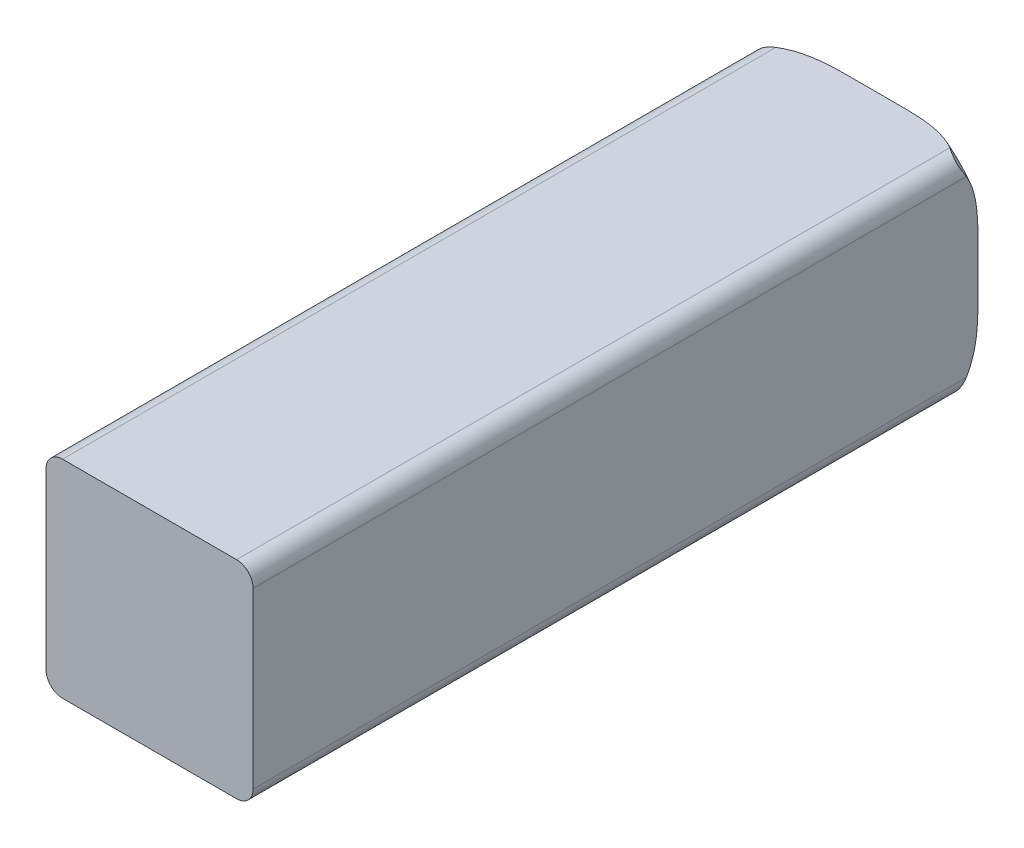
ISO-10303-21;
HEADER;
FILE_DESCRIPTION(('STEP AP214'),'2;1');
FILE_NAME('part.step','',(''),(''),'','','');
FILE_SCHEMA(('AUTOMOTIVE_DESIGN { 1 0 10303 214 1 1 1 1 }'));
ENDSEC;
DATA;
#1=APPLICATION_CONTEXT('core data for automotive mechanical design processes');
#2=APPLICATION_PROTOCOL_DEFINITION('international standard','automotive_design',2000,#1);
#3=PRODUCT_CONTEXT('',#1,'mechanical');
#4=PRODUCT('Part','Part','',(#3));
#5=PRODUCT_RELATED_PRODUCT_CATEGORY('part','',(#4));
#6=PRODUCT_DEFINITION_FORMATION('','',#4);
#7=PRODUCT_DEFINITION_CONTEXT('part definition',#1,'design');
#8=PRODUCT_DEFINITION('design','',#6,#7);
#9=PRODUCT_DEFINITION_SHAPE('','',#8);
#10=(LENGTH_UNIT() NAMED_UNIT(*) SI_UNIT(.MILLI.,.METRE.));
#11=(NAMED_UNIT(*) PLANE_ANGLE_UNIT() SI_UNIT($,.RADIAN.));
#12=(NAMED_UNIT(*) SI_UNIT($,.STERADIAN.) SOLID_ANGLE_UNIT());
#13=UNCERTAINTY_MEASURE_WITH_UNIT(LENGTH_MEASURE(1.E-05),#10,'distance_accuracy_value','');
#14=(GEOMETRIC_REPRESENTATION_CONTEXT(3) GLOBAL_UNCERTAINTY_ASSIGNED_CONTEXT((#13)) GLOBAL_UNIT_ASSIGNED_CONTEXT((#10,
#11,#12)) REPRESENTATION_CONTEXT('',''));
#15=CARTESIAN_POINT('',(0.,0.,0.));
#16=DIRECTION('',(0.,0.,1.));
#17=DIRECTION('',(1.,0.,0.));
#18=AXIS2_PLACEMENT_3D('',#15,#16,#17);
#19=CARTESIAN_POINT('',(0.,0.,-24.765));
#20=DIRECTION('',(0.,0.,1.));
#21=DIRECTION('',(1.,0.,0.));
#22=AXIS2_PLACEMENT_3D('',#19,#20,#21);
#23=TOROIDAL_SURFACE('',#22,1.63185378542452,0.635);
#24=CARTESIAN_POINT('',(1.5875,-1.33350000000001,-25.2214993180159));
#25=CARTESIAN_POINT('',(1.58748566897288,-1.34690792462914,-25.2131902383444));
#26=CARTESIAN_POINT('',(1.58643563491714,-1.36046268636275,-25.2049732030893));
#27=CARTESIAN_POINT('',(1.58201648662521,-1.38783838491251,-25.1892469870888));
#28=CARTESIAN_POINT('',(1.57861670279278,-1.40166046367848,-25.1817486789985));
#29=CARTESIAN_POINT('',(1.57058714220896,-1.42521880461481,-25.1701813537226));
#30=CARTESIAN_POINT('',(1.56659229292943,-1.43498690476737,-25.1657462781291));
#31=CARTESIAN_POINT('',(1.55721249958346,-1.45425932377619,-25.1580014330523));
#32=CARTESIAN_POINT('',(1.55183414419047,-1.46376466264463,-25.1546864976667));
#33=CARTESIAN_POINT('',(1.54064277647373,-1.48078992954893,-25.1499494031102));
#34=CARTESIAN_POINT('',(1.53503704758616,-1.48838416094885,-25.1483092418591));
#35=CARTESIAN_POINT('',(1.52291375209376,-1.50299443314631,-25.1462529778718));
#36=CARTESIAN_POINT('',(1.51639639905189,-1.51001060875298,-25.1458365889481));
#37=CARTESIAN_POINT('',(1.50263078678935,-1.52324184577942,-25.1462804295973));
#38=CARTESIAN_POINT('',(1.49538231587763,-1.52945667397998,-25.1471410299099));
#39=CARTESIAN_POINT('',(1.48038761855587,-1.54093535352863,-25.1500339763629));
#40=CARTESIAN_POINT('',(1.47264109349684,-1.54619862694723,-25.1520670314777));
#41=CARTESIAN_POINT('',(1.45446300659162,-1.5571701281181,-25.157864814596));
#42=CARTESIAN_POINT('',(1.44392996611573,-1.56252875091595,-25.161967806468));
#43=CARTESIAN_POINT('',(1.42264994892328,-1.57162418246107,-25.1713367713514));
#44=CARTESIAN_POINT('',(1.41190224866778,-1.57535394035416,-25.1766076544231));
#45=CARTESIAN_POINT('',(1.38976321513481,-1.58147222213898,-25.1882192454684));
#46=CARTESIAN_POINT('',(1.37837092259127,-1.58376977522872,-25.1946044346479));
#47=CARTESIAN_POINT('',(1.35579141019531,-1.58677095199112,-25.2078013248425));
#48=CARTESIAN_POINT('',(1.34460332096514,-1.58749208945789,-25.2146074664251));
#49=CARTESIAN_POINT('',(1.3335,-1.5875,-25.2214993180159));
#50=B_SPLINE_CURVE_WITH_KNOTS('',3,(#24,#25,#26,#27,#28,#29,#30,#31,#32,#33,#34,#35,#36,#37,#38,
#39,#40,#41,#42,#43,#44,#45,#46,#47,#48,#49),.UNSPECIFIED.,.F.,.F.,(4,2,2,2,2,2,2,2,2,2,2,2,4),
(0.,0.0474135575383103,0.0954579548320137,0.129685196647701,0.163752362077394,0.192367952546176,
0.220976850534815,0.249594055977997,0.278228584196794,0.315551990426709,0.353035394369269,
0.392706187180634,0.43193395327049),.UNSPECIFIED.);
#51=CARTESIAN_POINT('',(1.58749999999933,-1.33349999999976,-25.2214993180163));
#52=VERTEX_POINT('',#51);
#53=CARTESIAN_POINT('',(1.3335,-1.5875,-25.2214993180159));
#54=VERTEX_POINT('',#53);
#55=EDGE_CURVE('E138',#52,#54,#50,.T.);
#56=ORIENTED_EDGE('',*,*,#55,.T.);
#57=CARTESIAN_POINT('',(1.3335,-1.5875,-25.2214993180159));
#58=CARTESIAN_POINT('',(1.31039310118339,-1.5875,-25.2358652995629));
#59=CARTESIAN_POINT('',(1.2865956642968,-1.5875,-25.2490482576007));
#60=CARTESIAN_POINT('',(1.23796868030271,-1.5875,-25.2732235603891));
#61=CARTESIAN_POINT('',(1.21314134560692,-1.5875,-25.284220334021));
#62=CARTESIAN_POINT('',(1.13821413543874,-1.5875,-25.313985593762));
#63=CARTESIAN_POINT('',(1.08698851455542,-1.5875,-25.3299288510369));
#64=CARTESIAN_POINT('',(0.999962751237763,-1.5875,-25.3515855860613));
#65=CARTESIAN_POINT('',(0.964535612837992,-1.5875,-25.3589398885291));
#66=CARTESIAN_POINT('',(0.893247688923865,-1.5875,-25.3713838801317));
#67=CARTESIAN_POINT('',(0.857386498395727,-1.5875,-25.3764712545345));
#68=CARTESIAN_POINT('',(0.785399533338706,-1.5875,-25.3848313870659));
#69=CARTESIAN_POINT('',(0.749273402082695,-1.5875,-25.3881009072115));
#70=CARTESIAN_POINT('',(0.675801730227447,-1.5875,-25.3933189638327));
#71=CARTESIAN_POINT('',(0.638453184386328,-1.5875,-25.3952232897935));
#72=CARTESIAN_POINT('',(0.563797247200004,-1.5875,-25.3979718892388));
#73=CARTESIAN_POINT('',(0.526489923948468,-1.5875,-25.3988182849851));
#74=CARTESIAN_POINT('',(0.452078339022183,-1.5875,-25.3998256272711));
#75=CARTESIAN_POINT('',(0.414974136365072,-1.5875,-25.3999904665671));
#76=CARTESIAN_POINT('',(0.377876338243536,-1.5875,-25.4));
#77=B_SPLINE_CURVE_WITH_KNOTS('',3,(#57,#58,#59,#60,#61,#62,#63,#64,#65,#66,#67,#68,#69,#70,#71,
#72,#73,#74,#75,#76),.UNSPECIFIED.,.F.,.F.,(4,2,2,2,2,2,2,2,2,4),(0.,0.0815326247959326,
0.162898354774419,0.323290286001704,0.431774886900757,0.540370007655983,0.649157944635815,
0.761326732026148,0.873270140095043,0.984573284944613),.UNSPECIFIED.);
#78=CARTESIAN_POINT('',(0.377876338243536,-1.5875,-25.4));
#79=VERTEX_POINT('',#78);
#80=EDGE_CURVE('E143',#54,#79,#77,.T.);
#81=ORIENTED_EDGE('',*,*,#80,.T.);
#82=CARTESIAN_POINT('',(0.,0.,-25.4));
#83=DIRECTION('',(0.,0.,1.));
#84=DIRECTION('',(0.231562620143221,-0.97282000028392,0.));
#85=AXIS2_PLACEMENT_3D('',#82,#83,#84);
#86=CIRCLE('',#85,1.63185378542452);
#87=CARTESIAN_POINT('',(1.5875,-0.377876338243537,-25.4));
#88=VERTEX_POINT('',#87);
#89=EDGE_CURVE('E124',#88,#79,#86,.F.);
#90=ORIENTED_EDGE('',*,*,#89,.F.);
#91=CARTESIAN_POINT('',(1.5875,-0.377876338243537,-25.4));
#92=CARTESIAN_POINT('',(1.5875,-0.411612509119626,-25.3999933751559));
#93=CARTESIAN_POINT('',(1.5875,-0.445352736805657,-25.3998557902654));
#94=CARTESIAN_POINT('',(1.5875,-0.512942907948327,-25.3990478407271));
#95=CARTESIAN_POINT('',(1.5875,-0.546792826939162,-25.3983756336304));
#96=CARTESIAN_POINT('',(1.5875,-0.614509507764878,-25.3962226303108));
#97=CARTESIAN_POINT('',(1.5875,-0.648376243547029,-25.3947408964801));
#98=CARTESIAN_POINT('',(1.5875,-0.715189437993944,-25.3907056324485));
#99=CARTESIAN_POINT('',(1.5875,-0.748137535690098,-25.3881801182269));
#100=CARTESIAN_POINT('',(1.5875,-0.813874511250842,-25.3817497399492));
#101=CARTESIAN_POINT('',(1.5875,-0.846663515341614,-25.3778462570928));
#102=CARTESIAN_POINT('',(1.5875,-0.911972001446369,-25.3683282433345));
#103=CARTESIAN_POINT('',(1.5875,-0.944491567482064,-25.3627142681786));
#104=CARTESIAN_POINT('',(1.58750000000001,-1.03884990510626,-25.3432957352134));
#105=CARTESIAN_POINT('',(1.58750000000004,-1.10020590566776,-25.326702751592));
#106=CARTESIAN_POINT('',(1.58749999999999,-1.17979261140478,-25.297655047337));
#107=CARTESIAN_POINT('',(1.58749999999997,-1.19970518510336,-25.2897223580693));
#108=CARTESIAN_POINT('',(1.58750000000004,-1.23899757921714,-25.272570532428));
#109=CARTESIAN_POINT('',(1.58750000000013,-1.25837690634234,-25.2633502498628));
#110=CARTESIAN_POINT('',(1.58749999999987,-1.29648737036626,-25.243502020843));
#111=CARTESIAN_POINT('',(1.58749999999952,-1.31521592279952,-25.232869126592));
#112=CARTESIAN_POINT('',(1.58749999999867,-1.3334999999995,-25.2214993180167));
#113=B_SPLINE_CURVE_WITH_KNOTS('',3,(#91,#92,#93,#94,#95,#96,#97,#98,#99,#100,#101,#102,#103,
#104,#105,#106,#107,#108,#109,#110,#111,#112),.UNSPECIFIED.,.F.,.F.,(4,2,2,2,2,2,2,2,2,2,4),(0.,
0.101214578869633,0.202779489233488,0.304462283979966,0.403576841200485,0.502592332234145,
0.601575686961526,0.791402246158587,0.855672419606408,0.920000174261183,0.984559494506422),.UNSPECIFIED.);
#114=EDGE_CURVE('E85',#88,#52,#113,.T.);
#115=ORIENTED_EDGE('',*,*,#114,.T.);
#116=EDGE_LOOP('',(#56,#81,#90,#115));
#117=FACE_BOUND('',#116,.T.);
#118=ADVANCED_FACE('F33',(#117),#23,.T.);
#119=CARTESIAN_POINT('',(0.,0.,-24.765));
#120=DIRECTION('',(0.,0.,1.));
#121=DIRECTION('',(1.,0.,0.));
#122=AXIS2_PLACEMENT_3D('',#119,#120,#121);
#123=TOROIDAL_SURFACE('',#122,1.63185378542452,0.635);
#124=CARTESIAN_POINT('',(-1.33350000000001,-1.5875,-25.2214993180159));
#125=CARTESIAN_POINT('',(-1.34690792462914,-1.58748566897288,-25.2131902383444));
#126=CARTESIAN_POINT('',(-1.36046268636275,-1.58643563491714,-25.2049732030893));
#127=CARTESIAN_POINT('',(-1.38783838491252,-1.5820164866252,-25.1892469870888));
#128=CARTESIAN_POINT('',(-1.40166046367848,-1.57861670279278,-25.1817486789985));
#129=CARTESIAN_POINT('',(-1.42521880461481,-1.57058714220896,-25.1701813537226));
#130=CARTESIAN_POINT('',(-1.43498690476738,-1.56659229292943,-25.1657462781291));
#131=CARTESIAN_POINT('',(-1.45425932377619,-1.55721249958346,-25.1580014330523));
#132=CARTESIAN_POINT('',(-1.46376466264463,-1.55183414419047,-25.1546864976667));
#133=CARTESIAN_POINT('',(-1.48078992954894,-1.54064277647373,-25.1499494031102));
#134=CARTESIAN_POINT('',(-1.48838416094885,-1.53503704758616,-25.1483092418591));
#135=CARTESIAN_POINT('',(-1.50299443314631,-1.52291375209376,-25.1462529778718));
#136=CARTESIAN_POINT('',(-1.51001060875298,-1.51639639905189,-25.1458365889481));
#137=CARTESIAN_POINT('',(-1.52324184577942,-1.50263078678935,-25.1462804295973));
#138=CARTESIAN_POINT('',(-1.52945667397998,-1.49538231587763,-25.1471410299099));
#139=CARTESIAN_POINT('',(-1.54093535352863,-1.48038761855587,-25.1500339763629));
#140=CARTESIAN_POINT('',(-1.54619862694723,-1.47264109349684,-25.1520670314777));
#141=CARTESIAN_POINT('',(-1.5571701281181,-1.45446300659162,-25.157864814596));
#142=CARTESIAN_POINT('',(-1.56252875091595,-1.44392996611573,-25.161967806468));
#143=CARTESIAN_POINT('',(-1.57162418246107,-1.42264994892329,-25.1713367713514));
#144=CARTESIAN_POINT('',(-1.57535394035416,-1.41190224866778,-25.1766076544231));
#145=CARTESIAN_POINT('',(-1.58147222213898,-1.38976321513481,-25.1882192454684));
#146=CARTESIAN_POINT('',(-1.58376977522872,-1.37837092259127,-25.1946044346479));
#147=CARTESIAN_POINT('',(-1.58677095199112,-1.35579141019531,-25.2078013248425));
#148=CARTESIAN_POINT('',(-1.58749208945789,-1.34460332096514,-25.2146074664251));
#149=CARTESIAN_POINT('',(-1.5875,-1.3335,-25.2214993180159));
#150=B_SPLINE_CURVE_WITH_KNOTS('',3,(#124,#125,#126,#127,#128,#129,#130,#131,#132,#133,#134,
#135,#136,#137,#138,#139,#140,#141,#142,#143,#144,#145,#146,#147,#148,#149),.UNSPECIFIED.,.F.,
.F.,(4,2,2,2,2,2,2,2,2,2,2,2,4),(0.,0.0474135575383122,0.0954579548320149,0.129685196647703,
0.163752362077395,0.192367952546178,0.220976850534816,0.249594055977996,0.278228584196794,
0.315551990426708,0.353035394369269,0.392706187180634,0.431933953270492),.UNSPECIFIED.);
#151=CARTESIAN_POINT('',(-1.33349999999976,-1.58749999999933,-25.2214993180163));
#152=VERTEX_POINT('',#151);
#153=CARTESIAN_POINT('',(-1.5875,-1.3335,-25.2214993180159));
#154=VERTEX_POINT('',#153);
#155=EDGE_CURVE('E302',#152,#154,#150,.T.);
#156=ORIENTED_EDGE('',*,*,#155,.T.);
#157=CARTESIAN_POINT('',(-1.5875,-1.3335,-25.2214993180159));
#158=CARTESIAN_POINT('',(-1.5875,-1.31039310118339,-25.2358652995629));
#159=CARTESIAN_POINT('',(-1.5875,-1.2865956642968,-25.2490482576007));
#160=CARTESIAN_POINT('',(-1.5875,-1.23796868030272,-25.2732235603891));
#161=CARTESIAN_POINT('',(-1.5875,-1.21314134560692,-25.284220334021));
#162=CARTESIAN_POINT('',(-1.5875,-1.13821413543874,-25.313985593762));
#163=CARTESIAN_POINT('',(-1.58749999999999,-1.08698851455542,-25.3299288510369));
#164=CARTESIAN_POINT('',(-1.5875,-0.999962751237764,-25.3515855860613));
#165=CARTESIAN_POINT('',(-1.5875,-0.964535612837993,-25.3589398885291));
#166=CARTESIAN_POINT('',(-1.5875,-0.893247688923866,-25.3713838801317));
#167=CARTESIAN_POINT('',(-1.5875,-0.857386498395727,-25.3764712545345));
#168=CARTESIAN_POINT('',(-1.5875,-0.785399533338707,-25.3848313870659));
#169=CARTESIAN_POINT('',(-1.5875,-0.749273402082695,-25.3881009072115));
#170=CARTESIAN_POINT('',(-1.5875,-0.675801730227448,-25.3933189638327));
#171=CARTESIAN_POINT('',(-1.5875,-0.638453184386328,-25.3952232897935));
#172=CARTESIAN_POINT('',(-1.5875,-0.563797247200004,-25.3979718892388));
#173=CARTESIAN_POINT('',(-1.5875,-0.526489923948468,-25.3988182849851));
#174=CARTESIAN_POINT('',(-1.5875,-0.452078339022183,-25.3998256272711));
#175=CARTESIAN_POINT('',(-1.5875,-0.414974136365072,-25.3999904665671));
#176=CARTESIAN_POINT('',(-1.5875,-0.377876338243537,-25.4));
#177=B_SPLINE_CURVE_WITH_KNOTS('',3,(#157,#158,#159,#160,#161,#162,#163,#164,#165,#166,#167,
#168,#169,#170,#171,#172,#173,#174,#175,#176),.UNSPECIFIED.,.F.,.F.,(4,2,2,2,2,2,2,2,2,4),(0.,
0.0815326247959322,0.162898354774419,0.323290286001703,0.431774886900756,0.540370007655982,
0.649157944635815,0.761326732026148,0.873270140095042,0.984573284944613),.UNSPECIFIED.);
#178=CARTESIAN_POINT('',(-1.5875,-0.377876338243537,-25.4));
#179=VERTEX_POINT('',#178);
#180=EDGE_CURVE('E301',#154,#179,#177,.T.);
#181=ORIENTED_EDGE('',*,*,#180,.T.);
#182=CARTESIAN_POINT('',(0.,0.,-25.4));
#183=DIRECTION('',(0.,0.,1.));
#184=DIRECTION('',(-0.97282000028392,-0.231562620143221,0.));
#185=AXIS2_PLACEMENT_3D('',#182,#183,#184);
#186=CIRCLE('',#185,1.63185378542452);
#187=CARTESIAN_POINT('',(-0.377876338243537,-1.5875,-25.4));
#188=VERTEX_POINT('',#187);
#189=EDGE_CURVE('E197',#188,#179,#186,.F.);
#190=ORIENTED_EDGE('',*,*,#189,.F.);
#191=CARTESIAN_POINT('',(-0.377876338243537,-1.5875,-25.4));
#192=CARTESIAN_POINT('',(-0.411612509119626,-1.5875,-25.3999933751559));
#193=CARTESIAN_POINT('',(-0.445352736805656,-1.5875,-25.3998557902654));
#194=CARTESIAN_POINT('',(-0.512942907948327,-1.5875,-25.3990478407271));
#195=CARTESIAN_POINT('',(-0.546792826939162,-1.5875,-25.3983756336304));
#196=CARTESIAN_POINT('',(-0.614509507764878,-1.5875,-25.3962226303108));
#197=CARTESIAN_POINT('',(-0.648376243547029,-1.5875,-25.3947408964801));
#198=CARTESIAN_POINT('',(-0.715189437993944,-1.5875,-25.3907056324485));
#199=CARTESIAN_POINT('',(-0.748137535690098,-1.5875,-25.3881801182269));
#200=CARTESIAN_POINT('',(-0.813874511250842,-1.5875,-25.3817497399492));
#201=CARTESIAN_POINT('',(-0.846663515341614,-1.5875,-25.3778462570928));
#202=CARTESIAN_POINT('',(-0.911972001446368,-1.5875,-25.3683282433345));
#203=CARTESIAN_POINT('',(-0.944491567482064,-1.5875,-25.3627142681786));
#204=CARTESIAN_POINT('',(-1.03884990510626,-1.58750000000001,-25.3432957352134));
#205=CARTESIAN_POINT('',(-1.10020590566776,-1.58750000000004,-25.326702751592));
#206=CARTESIAN_POINT('',(-1.17979261140478,-1.58749999999999,-25.297655047337));
#207=CARTESIAN_POINT('',(-1.19970518510336,-1.58749999999997,-25.2897223580693));
#208=CARTESIAN_POINT('',(-1.23899757921714,-1.58750000000004,-25.272570532428));
#209=CARTESIAN_POINT('',(-1.25837690634234,-1.58750000000013,-25.2633502498628));
#210=CARTESIAN_POINT('',(-1.29648737036626,-1.58749999999987,-25.243502020843));
#211=CARTESIAN_POINT('',(-1.31521592279952,-1.58749999999952,-25.232869126592));
#212=CARTESIAN_POINT('',(-1.3334999999995,-1.58749999999867,-25.2214993180167));
#213=B_SPLINE_CURVE_WITH_KNOTS('',3,(#191,#192,#193,#194,#195,#196,#197,#198,#199,#200,#201,
#202,#203,#204,#205,#206,#207,#208,#209,#210,#211,#212),.UNSPECIFIED.,.F.,.F.,(4,2,2,2,2,2,2,2,
2,2,4),(0.,0.101214578869633,0.202779489233488,0.304462283979966,0.403576841200485,
0.502592332234144,0.601575686961526,0.791402246158587,0.855672419606408,0.920000174261183,
0.984559494506423),.UNSPECIFIED.);
#214=EDGE_CURVE('E308',#188,#152,#213,.T.);
#215=ORIENTED_EDGE('',*,*,#214,.T.);
#216=EDGE_LOOP('',(#156,#181,#190,#215));
#217=FACE_BOUND('',#216,.T.);
#218=ADVANCED_FACE('F258',(#217),#123,.T.);
#219=CARTESIAN_POINT('',(0.,0.,-24.765));
#220=DIRECTION('',(0.,0.,1.));
#221=DIRECTION('',(1.,0.,0.));
#222=AXIS2_PLACEMENT_3D('',#219,#220,#221);
#223=TOROIDAL_SURFACE('',#222,1.63185378542452,0.635);
#224=CARTESIAN_POINT('',(0.,0.,-25.4));
#225=DIRECTION('',(0.,0.,1.));
#226=DIRECTION('',(-0.231562620143221,0.97282000028392,0.));
#227=AXIS2_PLACEMENT_3D('',#224,#225,#226);
#228=CIRCLE('',#227,1.63185378542452);
#229=CARTESIAN_POINT('',(-1.5875,0.377876338243537,-25.4));
#230=VERTEX_POINT('',#229);
#231=CARTESIAN_POINT('',(-0.377876338243537,1.5875,-25.4));
#232=VERTEX_POINT('',#231);
#233=EDGE_CURVE('E210',#230,#232,#228,.F.);
#234=ORIENTED_EDGE('',*,*,#233,.F.);
#235=CARTESIAN_POINT('',(-1.5875,0.377876338243537,-25.4));
#236=CARTESIAN_POINT('',(-1.5875,0.411612509119626,-25.3999933751559));
#237=CARTESIAN_POINT('',(-1.5875,0.445352736805657,-25.3998557902654));
#238=CARTESIAN_POINT('',(-1.5875,0.512942907948327,-25.3990478407271));
#239=CARTESIAN_POINT('',(-1.5875,0.546792826939162,-25.3983756336304));
#240=CARTESIAN_POINT('',(-1.5875,0.614509507764879,-25.3962226303108));
#241=CARTESIAN_POINT('',(-1.5875,0.64837624354703,-25.3947408964801));
#242=CARTESIAN_POINT('',(-1.5875,0.715189437993945,-25.3907056324485));
#243=CARTESIAN_POINT('',(-1.5875,0.748137535690099,-25.3881801182269));
#244=CARTESIAN_POINT('',(-1.5875,0.813874511250844,-25.3817497399492));
#245=CARTESIAN_POINT('',(-1.5875,0.846663515341615,-25.3778462570928));
#246=CARTESIAN_POINT('',(-1.5875,0.91197200144637,-25.3683282433344));
#247=CARTESIAN_POINT('',(-1.5875,0.944491567482066,-25.3627142681786));
#248=CARTESIAN_POINT('',(-1.58750000000001,1.03884990510626,-25.3432957352134));
#249=CARTESIAN_POINT('',(-1.58750000000004,1.10020590566776,-25.326702751592));
#250=CARTESIAN_POINT('',(-1.58749999999999,1.17979261140478,-25.297655047337));
#251=CARTESIAN_POINT('',(-1.58749999999997,1.19970518510336,-25.2897223580693));
#252=CARTESIAN_POINT('',(-1.58750000000004,1.23899757921714,-25.272570532428));
#253=CARTESIAN_POINT('',(-1.58750000000013,1.25837690634234,-25.2633502498628));
#254=CARTESIAN_POINT('',(-1.58749999999987,1.29648737036626,-25.243502020843));
#255=CARTESIAN_POINT('',(-1.58749999999952,1.31521592279952,-25.232869126592));
#256=CARTESIAN_POINT('',(-1.58749999999867,1.3334999999995,-25.2214993180167));
#257=B_SPLINE_CURVE_WITH_KNOTS('',3,(#235,#236,#237,#238,#239,#240,#241,#242,#243,#244,#245,
#246,#247,#248,#249,#250,#251,#252,#253,#254,#255,#256),.UNSPECIFIED.,.F.,.F.,(4,2,2,2,2,2,2,2,
2,2,4),(0.,0.101214578869634,0.202779489233488,0.304462283979967,0.403576841200486,
0.502592332234146,0.601575686961528,0.791402246158586,0.855672419606407,0.920000174261182,
0.98455949450642),.UNSPECIFIED.);
#258=CARTESIAN_POINT('',(-1.58749999999933,1.33349999999975,-25.2214993180163));
#259=VERTEX_POINT('',#258);
#260=EDGE_CURVE('E132',#230,#259,#257,.T.);
#261=ORIENTED_EDGE('',*,*,#260,.T.);
#262=CARTESIAN_POINT('',(-1.5875,1.33350000000001,-25.2214993180159));
#263=CARTESIAN_POINT('',(-1.58748566897288,1.34690792462914,-25.2131902383444));
#264=CARTESIAN_POINT('',(-1.58643563491714,1.36046268636275,-25.2049732030893));
#265=CARTESIAN_POINT('',(-1.58201648662521,1.38783838491251,-25.1892469870888));
#266=CARTESIAN_POINT('',(-1.57861670279278,1.40166046367848,-25.1817486789985));
#267=CARTESIAN_POINT('',(-1.57058714220896,1.42521880461481,-25.1701813537226));
#268=CARTESIAN_POINT('',(-1.56659229292943,1.43498690476737,-25.1657462781291));
#269=CARTESIAN_POINT('',(-1.55721249958346,1.45425932377618,-25.1580014330523));
#270=CARTESIAN_POINT('',(-1.55183414419047,1.46376466264463,-25.1546864976667));
#271=CARTESIAN_POINT('',(-1.54064277647373,1.48078992954893,-25.1499494031102));
#272=CARTESIAN_POINT('',(-1.53503704758616,1.48838416094885,-25.1483092418591));
#273=CARTESIAN_POINT('',(-1.52291375209376,1.50299443314631,-25.1462529778718));
#274=CARTESIAN_POINT('',(-1.51639639905189,1.51001060875298,-25.1458365889481));
#275=CARTESIAN_POINT('',(-1.50263078678935,1.52324184577942,-25.1462804295973));
#276=CARTESIAN_POINT('',(-1.49538231587763,1.52945667397997,-25.1471410299099));
#277=CARTESIAN_POINT('',(-1.48038761855588,1.54093535352862,-25.1500339763629));
#278=CARTESIAN_POINT('',(-1.47264109349684,1.54619862694723,-25.1520670314777));
#279=CARTESIAN_POINT('',(-1.45446300659162,1.5571701281181,-25.157864814596));
#280=CARTESIAN_POINT('',(-1.44392996611573,1.56252875091595,-25.161967806468));
#281=CARTESIAN_POINT('',(-1.42264994892329,1.57162418246107,-25.1713367713514));
#282=CARTESIAN_POINT('',(-1.41190224866778,1.57535394035416,-25.1766076544231));
#283=CARTESIAN_POINT('',(-1.38976321513481,1.58147222213898,-25.1882192454684));
#284=CARTESIAN_POINT('',(-1.37837092259127,1.58376977522872,-25.1946044346479));
#285=CARTESIAN_POINT('',(-1.35579141019531,1.58677095199112,-25.2078013248425));
#286=CARTESIAN_POINT('',(-1.34460332096514,1.58749208945789,-25.2146074664251));
#287=CARTESIAN_POINT('',(-1.3335,1.5875,-25.2214993180159));
#288=B_SPLINE_CURVE_WITH_KNOTS('',3,(#262,#263,#264,#265,#266,#267,#268,#269,#270,#271,#272,
#273,#274,#275,#276,#277,#278,#279,#280,#281,#282,#283,#284,#285,#286,#287),.UNSPECIFIED.,.F.,
.F.,(4,2,2,2,2,2,2,2,2,2,2,2,4),(0.,0.0474135575383128,0.0954579548320153,0.129685196647703,
0.163752362077395,0.192367952546178,0.220976850534817,0.249594055977997,0.278228584196795,
0.315551990426711,0.353035394369271,0.392706187180637,0.431933953270493),.UNSPECIFIED.);
#289=CARTESIAN_POINT('',(-1.3335,1.5875,-25.2214993180159));
#290=VERTEX_POINT('',#289);
#291=EDGE_CURVE('E360',#259,#290,#288,.T.);
#292=ORIENTED_EDGE('',*,*,#291,.T.);
#293=CARTESIAN_POINT('',(-1.3335,1.5875,-25.2214993180159));
#294=CARTESIAN_POINT('',(-1.31039310118339,1.5875,-25.2358652995629));
#295=CARTESIAN_POINT('',(-1.2865956642968,1.5875,-25.2490482576007));
#296=CARTESIAN_POINT('',(-1.23796868030271,1.5875,-25.2732235603891));
#297=CARTESIAN_POINT('',(-1.21314134560692,1.5875,-25.284220334021));
#298=CARTESIAN_POINT('',(-1.13821413543874,1.5875,-25.313985593762));
#299=CARTESIAN_POINT('',(-1.08698851455542,1.58749999999999,-25.3299288510369));
#300=CARTESIAN_POINT('',(-0.999962751237763,1.5875,-25.3515855860613));
#301=CARTESIAN_POINT('',(-0.964535612837993,1.5875,-25.3589398885291));
#302=CARTESIAN_POINT('',(-0.893247688923866,1.5875,-25.3713838801317));
#303=CARTESIAN_POINT('',(-0.857386498395727,1.5875,-25.3764712545345));
#304=CARTESIAN_POINT('',(-0.785399533338706,1.5875,-25.3848313870659));
#305=CARTESIAN_POINT('',(-0.749273402082695,1.5875,-25.3881009072115));
#306=CARTESIAN_POINT('',(-0.675801730227447,1.5875,-25.3933189638327));
#307=CARTESIAN_POINT('',(-0.638453184386328,1.5875,-25.3952232897935));
#308=CARTESIAN_POINT('',(-0.563797247200004,1.5875,-25.3979718892388));
#309=CARTESIAN_POINT('',(-0.526489923948468,1.5875,-25.3988182849851));
#310=CARTESIAN_POINT('',(-0.452078339022183,1.5875,-25.3998256272711));
#311=CARTESIAN_POINT('',(-0.414974136365072,1.5875,-25.3999904665671));
#312=CARTESIAN_POINT('',(-0.377876338243536,1.5875,-25.4));
#313=B_SPLINE_CURVE_WITH_KNOTS('',3,(#293,#294,#295,#296,#297,#298,#299,#300,#301,#302,#303,
#304,#305,#306,#307,#308,#309,#310,#311,#312),.UNSPECIFIED.,.F.,.F.,(4,2,2,2,2,2,2,2,2,4),(0.,
0.0815326247959326,0.162898354774419,0.323290286001703,0.431774886900757,0.540370007655983,
0.649157944635815,0.761326732026148,0.873270140095043,0.984573284944614),.UNSPECIFIED.);
#314=EDGE_CURVE('E282',#290,#232,#313,.T.);
#315=ORIENTED_EDGE('',*,*,#314,.T.);
#316=EDGE_LOOP('',(#234,#261,#292,#315));
#317=FACE_BOUND('',#316,.T.);
#318=ADVANCED_FACE('F255',(#317),#223,.T.);
#319=CARTESIAN_POINT('',(-1.5875,1.5875,-25.4));
#320=DIRECTION('',(0.,0.,-1.));
#321=DIRECTION('',(-1.,0.,0.));
#322=AXIS2_PLACEMENT_3D('',#319,#320,#321);
#323=PLANE('',#322);
#324=DIRECTION('',(-1.,0.,0.));
#325=VECTOR('',#324,1.);
#326=CARTESIAN_POINT('',(-1.5875,1.5875,-25.4));
#327=LINE('',#326,#325);
#328=CARTESIAN_POINT('',(0.377876338243537,1.5875,-25.4));
#329=VERTEX_POINT('',#328);
#330=EDGE_CURVE('E223',#232,#329,#327,.F.);
#331=ORIENTED_EDGE('',*,*,#330,.T.);
#332=CARTESIAN_POINT('',(0.,0.,-25.4));
#333=DIRECTION('',(0.,0.,1.));
#334=DIRECTION('',(0.97282000028392,0.231562620143221,0.));
#335=AXIS2_PLACEMENT_3D('',#332,#333,#334);
#336=CIRCLE('',#335,1.63185378542452);
#337=CARTESIAN_POINT('',(1.5875,0.377876338243537,-25.4));
#338=VERTEX_POINT('',#337);
#339=EDGE_CURVE('E128',#338,#329,#336,.T.);
#340=ORIENTED_EDGE('',*,*,#339,.F.);
#341=DIRECTION('',(0.,1.,0.));
#342=VECTOR('',#341,1.);
#343=CARTESIAN_POINT('',(1.5875,1.5875,-25.4));
#344=LINE('',#343,#342);
#345=EDGE_CURVE('E122',#338,#88,#344,.F.);
#346=ORIENTED_EDGE('',*,*,#345,.T.);
#347=ORIENTED_EDGE('',*,*,#89,.T.);
#348=DIRECTION('',(-1.,0.,0.));
#349=VECTOR('',#348,1.);
#350=CARTESIAN_POINT('',(-1.5875,-1.5875,-25.4));
#351=LINE('',#350,#349);
#352=EDGE_CURVE('E144',#79,#188,#351,.T.);
#353=ORIENTED_EDGE('',*,*,#352,.T.);
#354=ORIENTED_EDGE('',*,*,#189,.T.);
#355=DIRECTION('',(0.,1.,0.));
#356=VECTOR('',#355,1.);
#357=CARTESIAN_POINT('',(-1.5875,1.5875,-25.4));
#358=LINE('',#357,#356);
#359=EDGE_CURVE('E232',#179,#230,#358,.T.);
#360=ORIENTED_EDGE('',*,*,#359,.T.);
#361=ORIENTED_EDGE('',*,*,#233,.T.);
#362=EDGE_LOOP('',(#331,#340,#346,#347,#353,#354,#360,#361));
#363=FACE_BOUND('',#362,.T.);
#364=ADVANCED_FACE('F123',(#363),#323,.T.);
#365=CARTESIAN_POINT('',(0.,0.,-24.765));
#366=DIRECTION('',(0.,0.,1.));
#367=DIRECTION('',(1.,0.,0.));
#368=AXIS2_PLACEMENT_3D('',#365,#366,#367);
#369=TOROIDAL_SURFACE('',#368,1.63185378542452,0.635);
#370=CARTESIAN_POINT('',(1.5875,1.3335,-25.2214993180159));
#371=CARTESIAN_POINT('',(1.58748566897288,1.34690792462913,-25.2131902383444));
#372=CARTESIAN_POINT('',(1.58643563491714,1.36046268636275,-25.2049732030893));
#373=CARTESIAN_POINT('',(1.58201648662521,1.38783838491251,-25.1892469870888));
#374=CARTESIAN_POINT('',(1.57861670279278,1.40166046367848,-25.1817486789985));
#375=CARTESIAN_POINT('',(1.57058714220896,1.42521880461481,-25.1701813537226));
#376=CARTESIAN_POINT('',(1.56659229292943,1.43498690476737,-25.1657462781291));
#377=CARTESIAN_POINT('',(1.55721249958346,1.45425932377618,-25.1580014330523));
#378=CARTESIAN_POINT('',(1.55183414419047,1.46376466264463,-25.1546864976667));
#379=CARTESIAN_POINT('',(1.54064277647373,1.48078992954893,-25.1499494031102));
#380=CARTESIAN_POINT('',(1.53503704758616,1.48838416094885,-25.1483092418591));
#381=CARTESIAN_POINT('',(1.52291375209376,1.50299443314631,-25.1462529778718));
#382=CARTESIAN_POINT('',(1.51639639905189,1.51001060875298,-25.1458365889481));
#383=CARTESIAN_POINT('',(1.50263078678935,1.52324184577942,-25.1462804295973));
#384=CARTESIAN_POINT('',(1.49538231587763,1.52945667397997,-25.1471410299099));
#385=CARTESIAN_POINT('',(1.48038761855588,1.54093535352862,-25.1500339763629));
#386=CARTESIAN_POINT('',(1.47264109349684,1.54619862694723,-25.1520670314777));
#387=CARTESIAN_POINT('',(1.45446300659162,1.5571701281181,-25.157864814596));
#388=CARTESIAN_POINT('',(1.44392996611573,1.56252875091595,-25.161967806468));
#389=CARTESIAN_POINT('',(1.42264994892329,1.57162418246107,-25.1713367713514));
#390=CARTESIAN_POINT('',(1.41190224866778,1.57535394035416,-25.1766076544231));
#391=CARTESIAN_POINT('',(1.38976321513482,1.58147222213898,-25.1882192454684));
#392=CARTESIAN_POINT('',(1.37837092259128,1.58376977522872,-25.1946044346479));
#393=CARTESIAN_POINT('',(1.35579141019532,1.58677095199112,-25.2078013248425));
#394=CARTESIAN_POINT('',(1.34460332096515,1.58749208945789,-25.2146074664251));
#395=CARTESIAN_POINT('',(1.33350000000001,1.5875,-25.2214993180159));
#396=B_SPLINE_CURVE_WITH_KNOTS('',3,(#370,#371,#372,#373,#374,#375,#376,#377,#378,#379,#380,
#381,#382,#383,#384,#385,#386,#387,#388,#389,#390,#391,#392,#393,#394,#395),.UNSPECIFIED.,.F.,
.F.,(4,2,2,2,2,2,2,2,2,2,2,2,4),(0.,0.0474135575383171,0.0954579548320258,0.129685196647713,
0.163752362077404,0.192367952546187,0.220976850534825,0.249594055978007,0.278228584196805,
0.31555199042672,0.35303539436928,0.392706187180641,0.43193395327049),.UNSPECIFIED.);
#397=CARTESIAN_POINT('',(1.5875,1.3335,-25.2214993180159));
#398=VERTEX_POINT('',#397);
#399=CARTESIAN_POINT('',(1.33349999999976,1.58749999999933,-25.2214993180163));
#400=VERTEX_POINT('',#399);
#401=EDGE_CURVE('E151',#398,#400,#396,.T.);
#402=ORIENTED_EDGE('',*,*,#401,.F.);
#403=CARTESIAN_POINT('',(1.5875,1.3335,-25.2214993180159));
#404=CARTESIAN_POINT('',(1.5875,1.31039310118339,-25.2358652995629));
#405=CARTESIAN_POINT('',(1.5875,1.2865956642968,-25.2490482576007));
#406=CARTESIAN_POINT('',(1.5875,1.23796868030272,-25.2732235603891));
#407=CARTESIAN_POINT('',(1.5875,1.21314134560692,-25.284220334021));
#408=CARTESIAN_POINT('',(1.5875,1.13821413543874,-25.313985593762));
#409=CARTESIAN_POINT('',(1.5875,1.08698851455542,-25.3299288510369));
#410=CARTESIAN_POINT('',(1.5875,0.999962751237765,-25.3515855860613));
#411=CARTESIAN_POINT('',(1.5875,0.964535612837994,-25.3589398885291));
#412=CARTESIAN_POINT('',(1.5875,0.893247688923867,-25.3713838801317));
#413=CARTESIAN_POINT('',(1.5875,0.857386498395728,-25.3764712545345));
#414=CARTESIAN_POINT('',(1.5875,0.785399533338707,-25.3848313870659));
#415=CARTESIAN_POINT('',(1.5875,0.749273402082696,-25.3881009072115));
#416=CARTESIAN_POINT('',(1.5875,0.675801730227448,-25.3933189638327));
#417=CARTESIAN_POINT('',(1.5875,0.638453184386329,-25.3952232897935));
#418=CARTESIAN_POINT('',(1.5875,0.563797247200004,-25.3979718892388));
#419=CARTESIAN_POINT('',(1.5875,0.526489923948468,-25.3988182849851));
#420=CARTESIAN_POINT('',(1.5875,0.452078339022184,-25.3998256272711));
#421=CARTESIAN_POINT('',(1.5875,0.414974136365072,-25.3999904665671));
#422=CARTESIAN_POINT('',(1.5875,0.377876338243536,-25.4));
#423=B_SPLINE_CURVE_WITH_KNOTS('',3,(#403,#404,#405,#406,#407,#408,#409,#410,#411,#412,#413,
#414,#415,#416,#417,#418,#419,#420,#421,#422),.UNSPECIFIED.,.F.,.F.,(4,2,2,2,2,2,2,2,2,4),(0.,
0.081532624795932,0.162898354774418,0.323290286001702,0.431774886900755,0.540370007655981,
0.649157944635814,0.761326732026148,0.873270140095042,0.984573284944613),.UNSPECIFIED.);
#424=EDGE_CURVE('E409',#398,#338,#423,.T.);
#425=ORIENTED_EDGE('',*,*,#424,.T.);
#426=ORIENTED_EDGE('',*,*,#339,.T.);
#427=CARTESIAN_POINT('',(0.377876338243537,1.5875,-25.4));
#428=CARTESIAN_POINT('',(0.411612509119626,1.5875,-25.3999933751559));
#429=CARTESIAN_POINT('',(0.445352736805656,1.5875,-25.3998557902654));
#430=CARTESIAN_POINT('',(0.512942907948326,1.5875,-25.3990478407271));
#431=CARTESIAN_POINT('',(0.546792826939162,1.5875,-25.3983756336304));
#432=CARTESIAN_POINT('',(0.614509507764878,1.5875,-25.3962226303108));
#433=CARTESIAN_POINT('',(0.648376243547029,1.5875,-25.3947408964801));
#434=CARTESIAN_POINT('',(0.715189437993944,1.5875,-25.3907056324485));
#435=CARTESIAN_POINT('',(0.748137535690098,1.5875,-25.3881801182269));
#436=CARTESIAN_POINT('',(0.813874511250842,1.5875,-25.3817497399492));
#437=CARTESIAN_POINT('',(0.846663515341614,1.5875,-25.3778462570928));
#438=CARTESIAN_POINT('',(0.911972001446368,1.5875,-25.3683282433344));
#439=CARTESIAN_POINT('',(0.944491567482064,1.5875,-25.3627142681786));
#440=CARTESIAN_POINT('',(1.03884990510626,1.58750000000001,-25.3432957352134));
#441=CARTESIAN_POINT('',(1.10020590566776,1.58750000000004,-25.326702751592));
#442=CARTESIAN_POINT('',(1.17979261140478,1.58749999999999,-25.297655047337));
#443=CARTESIAN_POINT('',(1.19970518510336,1.58749999999997,-25.2897223580693));
#444=CARTESIAN_POINT('',(1.23899757921714,1.58750000000004,-25.272570532428));
#445=CARTESIAN_POINT('',(1.25837690634234,1.58750000000013,-25.2633502498628));
#446=CARTESIAN_POINT('',(1.29648737036626,1.58749999999987,-25.243502020843));
#447=CARTESIAN_POINT('',(1.31521592279952,1.58749999999952,-25.232869126592));
#448=CARTESIAN_POINT('',(1.3334999999995,1.58749999999867,-25.2214993180167));
#449=B_SPLINE_CURVE_WITH_KNOTS('',3,(#427,#428,#429,#430,#431,#432,#433,#434,#435,#436,#437,
#438,#439,#440,#441,#442,#443,#444,#445,#446,#447,#448),.UNSPECIFIED.,.F.,.F.,(4,2,2,2,2,2,2,2,
2,2,4),(0.,0.101214578869633,0.202779489233488,0.304462283979966,0.403576841200485,
0.502592332234145,0.601575686961526,0.791402246158586,0.855672419606407,0.920000174261183,
0.984559494506422),.UNSPECIFIED.);
#450=EDGE_CURVE('E164',#329,#400,#449,.T.);
#451=ORIENTED_EDGE('',*,*,#450,.T.);
#452=EDGE_LOOP('',(#402,#425,#426,#451));
#453=FACE_BOUND('',#452,.T.);
#454=ADVANCED_FACE('F170',(#453),#369,.T.);
#455=CARTESIAN_POINT('',(-1.5875,1.5875,25.4));
#456=DIRECTION('',(0.,-1.,0.));
#457=DIRECTION('',(0.,0.,-1.));
#458=AXIS2_PLACEMENT_3D('',#455,#456,#457);
#459=PLANE('',#458);
#460=DIRECTION('',(0.,0.,-1.));
#461=VECTOR('',#460,1.);
#462=CARTESIAN_POINT('',(-1.33350000000001,1.5875,25.4));
#463=LINE('',#462,#461);
#464=CARTESIAN_POINT('',(-1.3335,1.5875,-14.2875));
#465=VERTEX_POINT('',#464);
#466=EDGE_CURVE('E380',#465,#290,#463,.T.);
#467=ORIENTED_EDGE('',*,*,#466,.F.);
#468=DIRECTION('',(-1.,0.,0.));
#469=VECTOR('',#468,1.);
#470=CARTESIAN_POINT('',(-10.7988410559869,1.5875,-14.2875));
#471=LINE('',#470,#469);
#472=CARTESIAN_POINT('',(1.3335,1.5875,-14.2875));
#473=VERTEX_POINT('',#472);
#474=EDGE_CURVE('E391',#473,#465,#471,.T.);
#475=ORIENTED_EDGE('',*,*,#474,.F.);
#476=DIRECTION('',(0.,0.,-1.));
#477=VECTOR('',#476,1.);
#478=CARTESIAN_POINT('',(1.33350000000001,1.5875,25.4));
#479=LINE('',#478,#477);
#480=EDGE_CURVE('E163',#400,#473,#479,.F.);
#481=ORIENTED_EDGE('',*,*,#480,.F.);
#482=ORIENTED_EDGE('',*,*,#450,.F.);
#483=ORIENTED_EDGE('',*,*,#330,.F.);
#484=ORIENTED_EDGE('',*,*,#314,.F.);
#485=EDGE_LOOP('',(#467,#475,#481,#482,#483,#484));
#486=FACE_BOUND('',#485,.T.);
#487=ADVANCED_FACE('F175',(#486),#459,.F.);
#488=CARTESIAN_POINT('',(1.3335,1.3335,25.4));
#489=DIRECTION('',(0.,0.,-1.));
#490=DIRECTION('',(-1.,0.,0.));
#491=AXIS2_PLACEMENT_3D('',#488,#489,#490);
#492=CYLINDRICAL_SURFACE('',#491,0.254);
#493=CARTESIAN_POINT('',(1.3335,1.3335,-14.2875));
#494=DIRECTION('',(0.,0.,-1.));
#495=DIRECTION('',(-1.,0.,0.));
#496=AXIS2_PLACEMENT_3D('',#493,#494,#495);
#497=CIRCLE('',#496,0.254);
#498=CARTESIAN_POINT('',(1.5875,1.33349999999988,-14.2875));
#499=VERTEX_POINT('',#498);
#500=EDGE_CURVE('E139',#499,#473,#497,.F.);
#501=ORIENTED_EDGE('',*,*,#500,.F.);
#502=DIRECTION('',(0.,0.,1.));
#503=VECTOR('',#502,1.);
#504=CARTESIAN_POINT('',(1.5875,1.33350000000001,25.4));
#505=LINE('',#504,#503);
#506=EDGE_CURVE('E57',#499,#398,#505,.F.);
#507=ORIENTED_EDGE('',*,*,#506,.T.);
#508=ORIENTED_EDGE('',*,*,#401,.T.);
#509=ORIENTED_EDGE('',*,*,#480,.T.);
#510=EDGE_LOOP('',(#501,#507,#508,#509));
#511=FACE_BOUND('',#510,.T.);
#512=ADVANCED_FACE('F166',(#511),#492,.T.);
#513=CARTESIAN_POINT('',(-1.3335,1.3335,25.4));
#514=DIRECTION('',(0.,0.,-1.));
#515=DIRECTION('',(-1.,0.,0.));
#516=AXIS2_PLACEMENT_3D('',#513,#514,#515);
#517=CYLINDRICAL_SURFACE('',#516,0.254);
#518=CARTESIAN_POINT('',(-1.3335,1.3335,-14.2875));
#519=DIRECTION('',(0.,0.,-1.));
#520=DIRECTION('',(-1.,0.,0.));
#521=AXIS2_PLACEMENT_3D('',#518,#519,#520);
#522=CIRCLE('',#521,0.254);
#523=CARTESIAN_POINT('',(-1.5875,1.33349999999988,-14.2875));
#524=VERTEX_POINT('',#523);
#525=EDGE_CURVE('E378',#465,#524,#522,.F.);
#526=ORIENTED_EDGE('',*,*,#525,.F.);
#527=ORIENTED_EDGE('',*,*,#466,.T.);
#528=ORIENTED_EDGE('',*,*,#291,.F.);
#529=DIRECTION('',(0.,0.,-1.));
#530=VECTOR('',#529,1.);
#531=CARTESIAN_POINT('',(-1.5875,1.33350000000001,25.4));
#532=LINE('',#531,#530);
#533=EDGE_CURVE('E382',#259,#524,#532,.F.);
#534=ORIENTED_EDGE('',*,*,#533,.T.);
#535=EDGE_LOOP('',(#526,#527,#528,#534));
#536=FACE_BOUND('',#535,.T.);
#537=ADVANCED_FACE('F367',(#536),#517,.T.);
#538=CARTESIAN_POINT('',(1.5875,-1.5875,25.4));
#539=DIRECTION('',(-1.,0.,0.));
#540=DIRECTION('',(0.,0.,1.));
#541=AXIS2_PLACEMENT_3D('',#538,#539,#540);
#542=PLANE('',#541);
#543=ORIENTED_EDGE('',*,*,#506,.F.);
#544=DIRECTION('',(0.,-1.,0.));
#545=VECTOR('',#544,1.);
#546=CARTESIAN_POINT('',(1.5875,-1.5875,-14.2875));
#547=LINE('',#546,#545);
#548=CARTESIAN_POINT('',(1.5875,-1.33349999999988,-14.2875));
#549=VERTEX_POINT('',#548);
#550=EDGE_CURVE('E93',#499,#549,#547,.T.);
#551=ORIENTED_EDGE('',*,*,#550,.T.);
#552=DIRECTION('',(0.,0.,-1.));
#553=VECTOR('',#552,1.);
#554=CARTESIAN_POINT('',(1.5875,-1.33350000000001,25.4));
#555=LINE('',#554,#553);
#556=EDGE_CURVE('E136',#52,#549,#555,.F.);
#557=ORIENTED_EDGE('',*,*,#556,.F.);
#558=ORIENTED_EDGE('',*,*,#114,.F.);
#559=ORIENTED_EDGE('',*,*,#345,.F.);
#560=ORIENTED_EDGE('',*,*,#424,.F.);
#561=EDGE_LOOP('',(#543,#551,#557,#558,#559,#560));
#562=FACE_BOUND('',#561,.T.);
#563=ADVANCED_FACE('F134',(#562),#542,.F.);
#564=CARTESIAN_POINT('',(-1.5875,-1.5875,25.4));
#565=DIRECTION('',(1.,0.,0.));
#566=DIRECTION('',(0.,0.,-1.));
#567=AXIS2_PLACEMENT_3D('',#564,#565,#566);
#568=PLANE('',#567);
#569=DIRECTION('',(0.,0.,-1.));
#570=VECTOR('',#569,1.);
#571=CARTESIAN_POINT('',(-1.5875,-1.3335,25.4));
#572=LINE('',#571,#570);
#573=CARTESIAN_POINT('',(-1.5875,-1.3335,-14.2875));
#574=VERTEX_POINT('',#573);
#575=EDGE_CURVE('E397',#574,#154,#572,.T.);
#576=ORIENTED_EDGE('',*,*,#575,.F.);
#577=DIRECTION('',(0.,1.,0.));
#578=VECTOR('',#577,1.);
#579=CARTESIAN_POINT('',(-1.5875,-1.5875,-14.2875));
#580=LINE('',#579,#578);
#581=EDGE_CURVE('E403',#574,#524,#580,.T.);
#582=ORIENTED_EDGE('',*,*,#581,.T.);
#583=ORIENTED_EDGE('',*,*,#533,.F.);
#584=ORIENTED_EDGE('',*,*,#260,.F.);
#585=ORIENTED_EDGE('',*,*,#359,.F.);
#586=ORIENTED_EDGE('',*,*,#180,.F.);
#587=EDGE_LOOP('',(#576,#582,#583,#584,#585,#586));
#588=FACE_BOUND('',#587,.T.);
#589=ADVANCED_FACE('F283',(#588),#568,.F.);
#590=CARTESIAN_POINT('',(1.3335,-1.3335,25.4));
#591=DIRECTION('',(0.,0.,-1.));
#592=DIRECTION('',(-1.,0.,0.));
#593=AXIS2_PLACEMENT_3D('',#590,#591,#592);
#594=CYLINDRICAL_SURFACE('',#593,0.254);
#595=CARTESIAN_POINT('',(1.3335,-1.3335,-14.2875));
#596=DIRECTION('',(0.,0.,-1.));
#597=DIRECTION('',(-1.,0.,0.));
#598=AXIS2_PLACEMENT_3D('',#595,#596,#597);
#599=CIRCLE('',#598,0.254);
#600=CARTESIAN_POINT('',(1.33349999999988,-1.5875,-14.2875));
#601=VERTEX_POINT('',#600);
#602=EDGE_CURVE('E405',#601,#549,#599,.F.);
#603=ORIENTED_EDGE('',*,*,#602,.F.);
#604=DIRECTION('',(0.,0.,1.));
#605=VECTOR('',#604,1.);
#606=CARTESIAN_POINT('',(1.33350000000001,-1.5875,25.4));
#607=LINE('',#606,#605);
#608=EDGE_CURVE('E343',#601,#54,#607,.F.);
#609=ORIENTED_EDGE('',*,*,#608,.T.);
#610=ORIENTED_EDGE('',*,*,#55,.F.);
#611=ORIENTED_EDGE('',*,*,#556,.T.);
#612=EDGE_LOOP('',(#603,#609,#610,#611));
#613=FACE_BOUND('',#612,.T.);
#614=ADVANCED_FACE('F288',(#613),#594,.T.);
#615=CARTESIAN_POINT('',(-1.3335,-1.3335,25.4));
#616=DIRECTION('',(0.,0.,-1.));
#617=DIRECTION('',(-1.,0.,0.));
#618=AXIS2_PLACEMENT_3D('',#615,#616,#617);
#619=CYLINDRICAL_SURFACE('',#618,0.254);
#620=CARTESIAN_POINT('',(-1.3335,-1.3335,-14.2875));
#621=DIRECTION('',(0.,0.,-1.));
#622=DIRECTION('',(-1.,0.,0.));
#623=AXIS2_PLACEMENT_3D('',#620,#621,#622);
#624=CIRCLE('',#623,0.254);
#625=CARTESIAN_POINT('',(-1.33350000000001,-1.5875,-14.2875));
#626=VERTEX_POINT('',#625);
#627=EDGE_CURVE('E49',#574,#626,#624,.F.);
#628=ORIENTED_EDGE('',*,*,#627,.F.);
#629=ORIENTED_EDGE('',*,*,#575,.T.);
#630=ORIENTED_EDGE('',*,*,#155,.F.);
#631=DIRECTION('',(0.,0.,1.));
#632=VECTOR('',#631,1.);
#633=CARTESIAN_POINT('',(-1.33350000000001,-1.5875,25.4));
#634=LINE('',#633,#632);
#635=EDGE_CURVE('E42',#152,#626,#634,.T.);
#636=ORIENTED_EDGE('',*,*,#635,.T.);
#637=EDGE_LOOP('',(#628,#629,#630,#636));
#638=FACE_BOUND('',#637,.T.);
#639=ADVANCED_FACE('F310',(#638),#619,.T.);
#640=CARTESIAN_POINT('',(-1.5875,-1.5875,25.4));
#641=DIRECTION('',(0.,1.,0.));
#642=DIRECTION('',(0.,0.,1.));
#643=AXIS2_PLACEMENT_3D('',#640,#641,#642);
#644=PLANE('',#643);
#645=ORIENTED_EDGE('',*,*,#608,.F.);
#646=DIRECTION('',(-1.,0.,0.));
#647=VECTOR('',#646,1.);
#648=CARTESIAN_POINT('',(-1.5875,-1.5875,-14.2875));
#649=LINE('',#648,#647);
#650=EDGE_CURVE('E11',#601,#626,#649,.T.);
#651=ORIENTED_EDGE('',*,*,#650,.T.);
#652=ORIENTED_EDGE('',*,*,#635,.F.);
#653=ORIENTED_EDGE('',*,*,#214,.F.);
#654=ORIENTED_EDGE('',*,*,#352,.F.);
#655=ORIENTED_EDGE('',*,*,#80,.F.);
#656=EDGE_LOOP('',(#645,#651,#652,#653,#654,#655));
#657=FACE_BOUND('',#656,.T.);
#658=ADVANCED_FACE('F314',(#657),#644,.F.);
#659=CARTESIAN_POINT('',(-10.7988410559869,-3.4925,-14.2875));
#660=DIRECTION('',(0.,0.,-1.));
#661=DIRECTION('',(-1.,0.,0.));
#662=AXIS2_PLACEMENT_3D('',#659,#660,#661);
#663=PLANE('',#662);
#664=ORIENTED_EDGE('',*,*,#500,.T.);
#665=ORIENTED_EDGE('',*,*,#474,.T.);
#666=ORIENTED_EDGE('',*,*,#525,.T.);
#667=ORIENTED_EDGE('',*,*,#581,.F.);
#668=ORIENTED_EDGE('',*,*,#627,.T.);
#669=ORIENTED_EDGE('',*,*,#650,.F.);
#670=ORIENTED_EDGE('',*,*,#602,.T.);
#671=ORIENTED_EDGE('',*,*,#550,.F.);
#672=EDGE_LOOP('',(#664,#665,#666,#667,#668,#669,#670,#671));
#673=FACE_BOUND('',#672,.T.);
#674=ADVANCED_FACE('F319',(#673),#663,.F.);
#675=CLOSED_SHELL('',(#118,#218,#318,#364,#454,#487,#512,#537,#563,#589,#614,#639,#658,#674));
#676=MANIFOLD_SOLID_BREP('B2',#675);
#677=ADVANCED_BREP_SHAPE_REPRESENTATION('',(#18,#676),#14);
#678=SHAPE_DEFINITION_REPRESENTATION(#9,#677);
ENDSEC;
END-ISO-10303-21;
